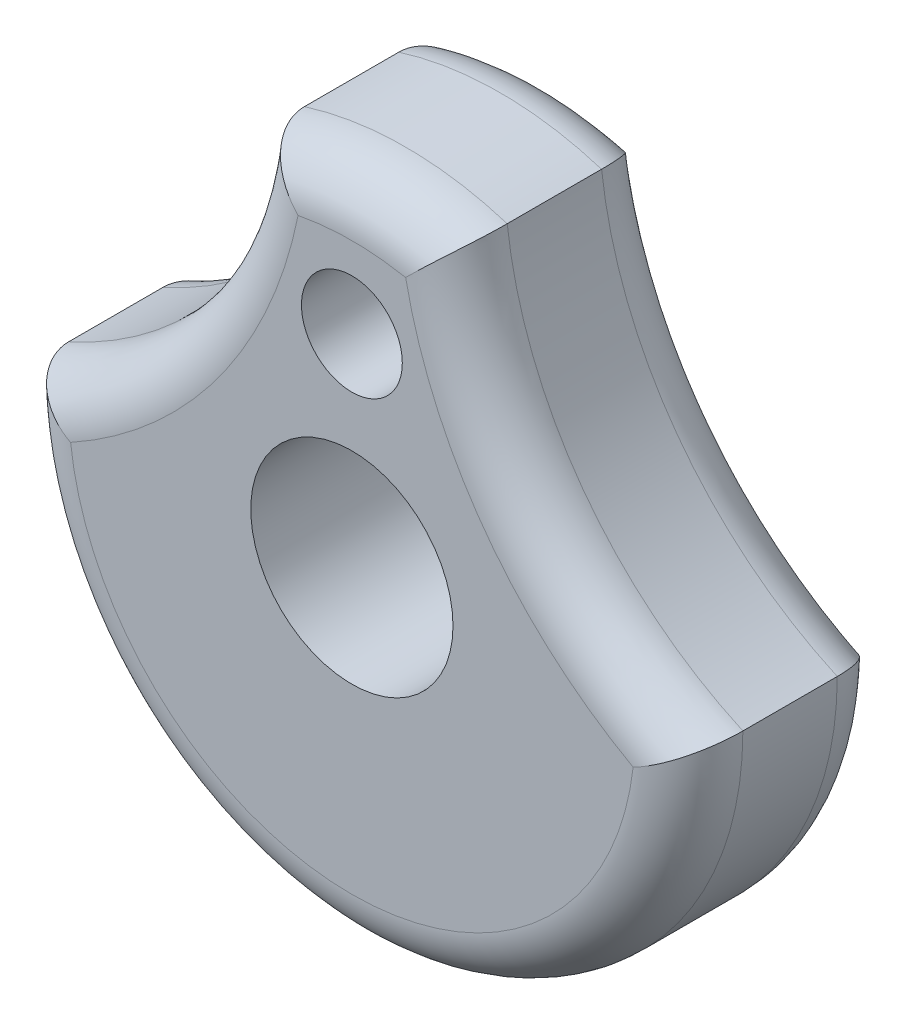
ISO-10303-21;
HEADER;
FILE_DESCRIPTION(('STEP AP214'),'2;1');
FILE_NAME('part.step','',(''),(''),'','','');
FILE_SCHEMA(('AUTOMOTIVE_DESIGN { 1 0 10303 214 1 1 1 1 }'));
ENDSEC;
DATA;
#1=APPLICATION_CONTEXT('core data for automotive mechanical design processes');
#2=APPLICATION_PROTOCOL_DEFINITION('international standard','automotive_design',2000,#1);
#3=PRODUCT_CONTEXT('',#1,'mechanical');
#4=PRODUCT('Part','Part','',(#3));
#5=PRODUCT_RELATED_PRODUCT_CATEGORY('part','',(#4));
#6=PRODUCT_DEFINITION_FORMATION('','',#4);
#7=PRODUCT_DEFINITION_CONTEXT('part definition',#1,'design');
#8=PRODUCT_DEFINITION('design','',#6,#7);
#9=PRODUCT_DEFINITION_SHAPE('','',#8);
#10=(LENGTH_UNIT() NAMED_UNIT(*) SI_UNIT(.MILLI.,.METRE.));
#11=(NAMED_UNIT(*) PLANE_ANGLE_UNIT() SI_UNIT($,.RADIAN.));
#12=(NAMED_UNIT(*) SI_UNIT($,.STERADIAN.) SOLID_ANGLE_UNIT());
#13=UNCERTAINTY_MEASURE_WITH_UNIT(LENGTH_MEASURE(1.E-05),#10,'distance_accuracy_value','');
#14=(GEOMETRIC_REPRESENTATION_CONTEXT(3) GLOBAL_UNCERTAINTY_ASSIGNED_CONTEXT((#13)) GLOBAL_UNIT_ASSIGNED_CONTEXT((#10,
#11,#12)) REPRESENTATION_CONTEXT('',''));
#15=CARTESIAN_POINT('',(0.,0.,0.));
#16=DIRECTION('',(0.,0.,1.));
#17=DIRECTION('',(1.,0.,0.));
#18=AXIS2_PLACEMENT_3D('',#15,#16,#17);
#19=CARTESIAN_POINT('',(0.,0.,9.525));
#20=DIRECTION('',(0.,0.,-1.));
#21=DIRECTION('',(-1.,0.,0.));
#22=AXIS2_PLACEMENT_3D('',#19,#20,#21);
#23=CYLINDRICAL_SURFACE('',#22,15.875);
#24=DIRECTION('',(0.,0.,1.));
#25=VECTOR('',#24,1.);
#26=CARTESIAN_POINT('',(4.7752,15.1397850037575,0.3175));
#27=LINE('',#26,#25);
#28=CARTESIAN_POINT('',(4.7752,15.1397850037575,2.54));
#29=VERTEX_POINT('',#28);
#30=CARTESIAN_POINT('',(4.7752,15.1397850037575,6.985));
#31=VERTEX_POINT('',#30);
#32=EDGE_CURVE('E147',#29,#31,#27,.T.);
#33=ORIENTED_EDGE('',*,*,#32,.F.);
#34=CARTESIAN_POINT('',(0.,0.,2.54));
#35=DIRECTION('',(0.,0.,1.));
#36=DIRECTION('',(1.,0.,0.));
#37=AXIS2_PLACEMENT_3D('',#34,#35,#36);
#38=CIRCLE('',#37,15.875);
#39=CARTESIAN_POINT('',(-4.7752,15.1397850037575,2.54));
#40=VERTEX_POINT('',#39);
#41=EDGE_CURVE('E304',#29,#40,#38,.T.);
#42=ORIENTED_EDGE('',*,*,#41,.T.);
#43=DIRECTION('',(0.,0.,1.));
#44=VECTOR('',#43,1.);
#45=CARTESIAN_POINT('',(-4.7752,15.1397850037575,0.3175));
#46=LINE('',#45,#44);
#47=CARTESIAN_POINT('',(-4.7752,15.1397850037575,6.985));
#48=VERTEX_POINT('',#47);
#49=EDGE_CURVE('E137',#40,#48,#46,.T.);
#50=ORIENTED_EDGE('',*,*,#49,.T.);
#51=CARTESIAN_POINT('',(0.,0.,6.985));
#52=DIRECTION('',(0.,0.,1.));
#53=DIRECTION('',(1.,0.,0.));
#54=AXIS2_PLACEMENT_3D('',#51,#52,#53);
#55=CIRCLE('',#54,15.875);
#56=EDGE_CURVE('E162',#48,#31,#55,.F.);
#57=ORIENTED_EDGE('',*,*,#56,.T.);
#58=EDGE_LOOP('',(#33,#42,#50,#57));
#59=FACE_BOUND('',#58,.T.);
#60=ADVANCED_FACE('F42',(#59),#23,.T.);
#61=DIRECTION('',(0.,0.,1.));
#62=VECTOR('',#61,1.);
#63=CARTESIAN_POINT('',(-15.875,0.,0.3175));
#64=LINE('',#63,#62);
#65=CARTESIAN_POINT('',(-15.875,0.,6.985));
#66=VERTEX_POINT('',#65);
#67=CARTESIAN_POINT('',(-15.875,0.,2.54));
#68=VERTEX_POINT('',#67);
#69=EDGE_CURVE('E292',#66,#68,#64,.F.);
#70=ORIENTED_EDGE('',*,*,#69,.T.);
#71=CARTESIAN_POINT('',(0.,0.,2.54));
#72=DIRECTION('',(0.,0.,1.));
#73=DIRECTION('',(1.,0.,0.));
#74=AXIS2_PLACEMENT_3D('',#71,#72,#73);
#75=CIRCLE('',#74,15.875);
#76=CARTESIAN_POINT('',(15.875,0.,2.54));
#77=VERTEX_POINT('',#76);
#78=EDGE_CURVE('E11',#68,#77,#75,.T.);
#79=ORIENTED_EDGE('',*,*,#78,.T.);
#80=DIRECTION('',(0.,0.,1.));
#81=VECTOR('',#80,1.);
#82=CARTESIAN_POINT('',(15.875,0.,0.3175));
#83=LINE('',#82,#81);
#84=CARTESIAN_POINT('',(15.875,0.,6.985));
#85=VERTEX_POINT('',#84);
#86=EDGE_CURVE('E144',#85,#77,#83,.F.);
#87=ORIENTED_EDGE('',*,*,#86,.F.);
#88=CARTESIAN_POINT('',(0.,0.,6.985));
#89=DIRECTION('',(0.,0.,1.));
#90=DIRECTION('',(1.,0.,0.));
#91=AXIS2_PLACEMENT_3D('',#88,#89,#90);
#92=CIRCLE('',#91,15.875);
#93=EDGE_CURVE('E168',#85,#66,#92,.F.);
#94=ORIENTED_EDGE('',*,*,#93,.T.);
#95=EDGE_LOOP('',(#70,#79,#87,#94));
#96=FACE_BOUND('',#95,.T.);
#97=ADVANCED_FACE('F251',(#96),#23,.T.);
#98=CARTESIAN_POINT('',(0.,0.,9.525));
#99=DIRECTION('',(0.,0.,1.));
#100=DIRECTION('',(1.,0.,0.));
#101=AXIS2_PLACEMENT_3D('',#98,#99,#100);
#102=PLANE('',#101);
#103=CARTESIAN_POINT('',(0.,0.,9.525));
#104=DIRECTION('',(0.,0.,1.));
#105=DIRECTION('',(1.,0.,0.));
#106=AXIS2_PLACEMENT_3D('',#103,#104,#105);
#107=CIRCLE('',#106,13.335);
#108=CARTESIAN_POINT('',(-13.247728473695,-1.5231268125964,9.525));
#109=VERTEX_POINT('',#108);
#110=CARTESIAN_POINT('',(13.247728473695,-1.52312681259641,9.525));
#111=VERTEX_POINT('',#110);
#112=EDGE_CURVE('E119',#109,#111,#107,.T.);
#113=ORIENTED_EDGE('',*,*,#112,.T.);
#114=CARTESIAN_POINT('',(23.6940383838059,17.3713885096318,9.525));
#115=DIRECTION('',(0.,0.,1.));
#116=DIRECTION('',(1.,0.,0.));
#117=AXIS2_PLACEMENT_3D('',#114,#115,#116);
#118=CIRCLE('',#117,21.59);
#119=CARTESIAN_POINT('',(2.53233011221546,13.0923462069549,9.525));
#120=VERTEX_POINT('',#119);
#121=EDGE_CURVE('E155',#111,#120,#118,.F.);
#122=ORIENTED_EDGE('',*,*,#121,.T.);
#123=CARTESIAN_POINT('',(0.,0.,9.525));
#124=DIRECTION('',(0.,0.,1.));
#125=DIRECTION('',(1.,0.,0.));
#126=AXIS2_PLACEMENT_3D('',#123,#124,#125);
#127=CIRCLE('',#126,13.335);
#128=CARTESIAN_POINT('',(-2.53233011221546,13.0923462069549,9.525));
#129=VERTEX_POINT('',#128);
#130=EDGE_CURVE('E122',#120,#129,#127,.T.);
#131=ORIENTED_EDGE('',*,*,#130,.T.);
#132=CARTESIAN_POINT('',(-23.6940383838059,17.3713885096318,9.525));
#133=DIRECTION('',(0.,0.,1.));
#134=DIRECTION('',(1.,0.,0.));
#135=AXIS2_PLACEMENT_3D('',#132,#133,#134);
#136=CIRCLE('',#135,21.59);
#137=EDGE_CURVE('E113',#129,#109,#136,.F.);
#138=ORIENTED_EDGE('',*,*,#137,.T.);
#139=EDGE_LOOP('',(#113,#122,#131,#138));
#140=FACE_BOUND('',#139,.T.);
#141=CARTESIAN_POINT('',(0.,0.,9.525));
#142=DIRECTION('',(0.,0.,1.));
#143=DIRECTION('',(1.,0.,0.));
#144=AXIS2_PLACEMENT_3D('',#141,#142,#143);
#145=CIRCLE('',#144,4.7625);
#146=CARTESIAN_POINT('',(4.7625,0.,9.525));
#147=VERTEX_POINT('',#146);
#148=EDGE_CURVE('E281',#147,#147,#145,.T.);
#149=ORIENTED_EDGE('',*,*,#148,.F.);
#150=EDGE_LOOP('',(#149));
#151=FACE_BOUND('',#150,.T.);
#152=CARTESIAN_POINT('',(0.,9.525,9.525));
#153=DIRECTION('',(0.,0.,1.));
#154=DIRECTION('',(1.,0.,0.));
#155=AXIS2_PLACEMENT_3D('',#152,#153,#154);
#156=CIRCLE('',#155,2.3749);
#157=CARTESIAN_POINT('',(2.3749,9.525,9.525));
#158=VERTEX_POINT('',#157);
#159=EDGE_CURVE('E150',#158,#158,#156,.T.);
#160=ORIENTED_EDGE('',*,*,#159,.F.);
#161=EDGE_LOOP('',(#160));
#162=FACE_BOUND('',#161,.T.);
#163=ADVANCED_FACE('F115',(#140,#151,#162),#102,.T.);
#164=CARTESIAN_POINT('',(0.,0.,0.));
#165=DIRECTION('',(0.,0.,1.));
#166=DIRECTION('',(1.,0.,0.));
#167=AXIS2_PLACEMENT_3D('',#164,#165,#166);
#168=PLANE('',#167);
#169=CARTESIAN_POINT('',(0.,0.,0.));
#170=DIRECTION('',(0.,0.,1.));
#171=DIRECTION('',(1.,0.,0.));
#172=AXIS2_PLACEMENT_3D('',#169,#170,#171);
#173=CIRCLE('',#172,13.335);
#174=CARTESIAN_POINT('',(13.247728473695,-1.52312681259641,0.));
#175=VERTEX_POINT('',#174);
#176=CARTESIAN_POINT('',(-13.247728473695,-1.5231268125964,0.));
#177=VERTEX_POINT('',#176);
#178=EDGE_CURVE('E171',#175,#177,#173,.F.);
#179=ORIENTED_EDGE('',*,*,#178,.T.);
#180=CARTESIAN_POINT('',(-23.6940383838059,17.3713885096318,0.));
#181=DIRECTION('',(0.,0.,1.));
#182=DIRECTION('',(1.,0.,0.));
#183=AXIS2_PLACEMENT_3D('',#180,#181,#182);
#184=CIRCLE('',#183,21.59);
#185=CARTESIAN_POINT('',(-2.53233011221546,13.0923462069549,0.));
#186=VERTEX_POINT('',#185);
#187=EDGE_CURVE('E324',#177,#186,#184,.T.);
#188=ORIENTED_EDGE('',*,*,#187,.T.);
#189=CARTESIAN_POINT('',(0.,0.,0.));
#190=DIRECTION('',(0.,0.,1.));
#191=DIRECTION('',(1.,0.,0.));
#192=AXIS2_PLACEMENT_3D('',#189,#190,#191);
#193=CIRCLE('',#192,13.335);
#194=CARTESIAN_POINT('',(2.53233011221546,13.0923462069549,0.));
#195=VERTEX_POINT('',#194);
#196=EDGE_CURVE('E330',#186,#195,#193,.F.);
#197=ORIENTED_EDGE('',*,*,#196,.T.);
#198=CARTESIAN_POINT('',(23.6940383838059,17.3713885096318,0.));
#199=DIRECTION('',(0.,0.,1.));
#200=DIRECTION('',(1.,0.,0.));
#201=AXIS2_PLACEMENT_3D('',#198,#199,#200);
#202=CIRCLE('',#201,21.59);
#203=EDGE_CURVE('E314',#195,#175,#202,.T.);
#204=ORIENTED_EDGE('',*,*,#203,.T.);
#205=EDGE_LOOP('',(#179,#188,#197,#204));
#206=FACE_BOUND('',#205,.T.);
#207=CARTESIAN_POINT('',(0.,9.525,0.));
#208=DIRECTION('',(0.,0.,1.));
#209=DIRECTION('',(1.,0.,0.));
#210=AXIS2_PLACEMENT_3D('',#207,#208,#209);
#211=CIRCLE('',#210,2.3749);
#212=CARTESIAN_POINT('',(2.3749,9.525,0.));
#213=VERTEX_POINT('',#212);
#214=EDGE_CURVE('E287',#213,#213,#211,.T.);
#215=ORIENTED_EDGE('',*,*,#214,.T.);
#216=EDGE_LOOP('',(#215));
#217=FACE_BOUND('',#216,.T.);
#218=CARTESIAN_POINT('',(0.,0.,0.));
#219=DIRECTION('',(0.,0.,1.));
#220=DIRECTION('',(1.,0.,0.));
#221=AXIS2_PLACEMENT_3D('',#218,#219,#220);
#222=CIRCLE('',#221,4.7625);
#223=CARTESIAN_POINT('',(4.7625,0.,0.));
#224=VERTEX_POINT('',#223);
#225=EDGE_CURVE('E284',#224,#224,#222,.T.);
#226=ORIENTED_EDGE('',*,*,#225,.T.);
#227=EDGE_LOOP('',(#226));
#228=FACE_BOUND('',#227,.T.);
#229=ADVANCED_FACE('F257',(#206,#217,#228),#168,.F.);
#230=CARTESIAN_POINT('',(0.,0.,-8.89));
#231=DIRECTION('',(0.,0.,1.));
#232=DIRECTION('',(1.,0.,0.));
#233=AXIS2_PLACEMENT_3D('',#230,#231,#232);
#234=CYLINDRICAL_SURFACE('',#233,4.7625);
#235=ORIENTED_EDGE('',*,*,#148,.T.);
#236=EDGE_LOOP('',(#235));
#237=FACE_BOUND('',#236,.T.);
#238=ORIENTED_EDGE('',*,*,#225,.F.);
#239=EDGE_LOOP('',(#238));
#240=FACE_BOUND('',#239,.T.);
#241=ADVANCED_FACE('F260',(#237,#240),#234,.F.);
#242=CARTESIAN_POINT('',(0.,9.525,-8.89));
#243=DIRECTION('',(0.,0.,1.));
#244=DIRECTION('',(1.,0.,0.));
#245=AXIS2_PLACEMENT_3D('',#242,#243,#244);
#246=CYLINDRICAL_SURFACE('',#245,2.3749);
#247=ORIENTED_EDGE('',*,*,#159,.T.);
#248=EDGE_LOOP('',(#247));
#249=FACE_BOUND('',#248,.T.);
#250=ORIENTED_EDGE('',*,*,#214,.F.);
#251=EDGE_LOOP('',(#250));
#252=FACE_BOUND('',#251,.T.);
#253=ADVANCED_FACE('F270',(#249,#252),#246,.F.);
#254=CARTESIAN_POINT('',(23.6940383838059,17.3713885096318,-8.89));
#255=DIRECTION('',(0.,0.,1.));
#256=DIRECTION('',(1.,0.,0.));
#257=AXIS2_PLACEMENT_3D('',#254,#255,#256);
#258=CYLINDRICAL_SURFACE('',#257,19.05);
#259=ORIENTED_EDGE('',*,*,#86,.T.);
#260=CARTESIAN_POINT('',(23.6940383838059,17.3713885096318,2.54));
#261=DIRECTION('',(0.,0.,1.));
#262=DIRECTION('',(1.,0.,0.));
#263=AXIS2_PLACEMENT_3D('',#260,#261,#262);
#264=CIRCLE('',#263,19.05);
#265=EDGE_CURVE('E57',#77,#29,#264,.F.);
#266=ORIENTED_EDGE('',*,*,#265,.T.);
#267=ORIENTED_EDGE('',*,*,#32,.T.);
#268=CARTESIAN_POINT('',(23.6940383838059,17.3713885096318,6.985));
#269=DIRECTION('',(0.,0.,1.));
#270=DIRECTION('',(1.,0.,0.));
#271=AXIS2_PLACEMENT_3D('',#268,#269,#270);
#272=CIRCLE('',#271,19.05);
#273=EDGE_CURVE('E158',#31,#85,#272,.T.);
#274=ORIENTED_EDGE('',*,*,#273,.T.);
#275=EDGE_LOOP('',(#259,#266,#267,#274));
#276=FACE_BOUND('',#275,.T.);
#277=ADVANCED_FACE('F266',(#276),#258,.F.);
#278=CARTESIAN_POINT('',(-23.6940383838059,17.3713885096318,-8.89));
#279=DIRECTION('',(0.,0.,1.));
#280=DIRECTION('',(1.,0.,0.));
#281=AXIS2_PLACEMENT_3D('',#278,#279,#280);
#282=CYLINDRICAL_SURFACE('',#281,19.05);
#283=ORIENTED_EDGE('',*,*,#49,.F.);
#284=CARTESIAN_POINT('',(-23.6940383838059,17.3713885096318,2.54));
#285=DIRECTION('',(0.,0.,1.));
#286=DIRECTION('',(1.,0.,0.));
#287=AXIS2_PLACEMENT_3D('',#284,#285,#286);
#288=CIRCLE('',#287,19.05);
#289=EDGE_CURVE('E319',#40,#68,#288,.F.);
#290=ORIENTED_EDGE('',*,*,#289,.T.);
#291=ORIENTED_EDGE('',*,*,#69,.F.);
#292=CARTESIAN_POINT('',(-23.6940383838059,17.3713885096318,6.985));
#293=DIRECTION('',(0.,0.,1.));
#294=DIRECTION('',(1.,0.,0.));
#295=AXIS2_PLACEMENT_3D('',#292,#293,#294);
#296=CIRCLE('',#295,19.05);
#297=EDGE_CURVE('E133',#66,#48,#296,.T.);
#298=ORIENTED_EDGE('',*,*,#297,.T.);
#299=EDGE_LOOP('',(#283,#290,#291,#298));
#300=FACE_BOUND('',#299,.T.);
#301=ADVANCED_FACE('F210',(#300),#282,.F.);
#302=CARTESIAN_POINT('',(-23.6940383838059,17.3713885096318,6.985));
#303=DIRECTION('',(0.,0.,1.));
#304=DIRECTION('',(1.,0.,0.));
#305=AXIS2_PLACEMENT_3D('',#302,#303,#304);
#306=TOROIDAL_SURFACE('',#305,21.59,2.54);
#307=CARTESIAN_POINT('',(-4.7752,15.1397850037575,6.985));
#308=CARTESIAN_POINT('',(-4.7752115681018,15.1397925817922,7.04826242028002));
#309=CARTESIAN_POINT('',(-4.77303212651408,15.1379908448443,7.11151793293338));
#310=CARTESIAN_POINT('',(-4.76437952419241,15.13082723461,7.23750788695464));
#311=CARTESIAN_POINT('',(-4.75790802966657,15.125466742859,7.30024252096633));
#312=CARTESIAN_POINT('',(-4.74080082310005,15.1112783097033,7.42443328076446));
#313=CARTESIAN_POINT('',(-4.73018533268593,15.1024672057349,7.48589411144455));
#314=CARTESIAN_POINT('',(-4.70496145064737,15.0814921089141,7.60739327909863));
#315=CARTESIAN_POINT('',(-4.69035284063049,15.0693279326746,7.66743153807385));
#316=CARTESIAN_POINT('',(-4.64086975762492,15.0280307568218,7.84465575111746));
#317=CARTESIAN_POINT('',(-4.60030141536724,14.9940630078747,7.95920928073866));
#318=CARTESIAN_POINT('',(-4.50606755527998,14.9146212980624,8.17850137931814));
#319=CARTESIAN_POINT('',(-4.45238879811965,14.8691357043784,8.28322987773149));
#320=CARTESIAN_POINT('',(-4.33077187826595,14.7652264100579,8.48695286129147));
#321=CARTESIAN_POINT('',(-4.26218054287924,14.7061989156945,8.58524738782864));
#322=CARTESIAN_POINT('',(-4.11560947840222,14.5787875318009,8.76765335364544));
#323=CARTESIAN_POINT('',(-4.0376279220665,14.5104018208986,8.85176202482704));
#324=CARTESIAN_POINT('',(-3.86240649099922,14.3550240109159,9.01681394355266));
#325=CARTESIAN_POINT('',(-3.76403458199722,14.2667806230615,9.09537543600797));
#326=CARTESIAN_POINT('',(-3.5611413114909,14.0822304123791,9.23280593451396));
#327=CARTESIAN_POINT('',(-3.45661184109662,13.9859128828088,9.29164825849498));
#328=CARTESIAN_POINT('',(-3.21762758553347,13.7624445383172,9.40186348651171));
#329=CARTESIAN_POINT('',(-3.0822103755667,13.6335942502475,9.44771486608128));
#330=CARTESIAN_POINT('',(-2.81058884478541,13.3701206503433,9.50897142691469));
#331=CARTESIAN_POINT('',(-2.67438675848191,13.2355099573189,9.52443999423692));
#332=CARTESIAN_POINT('',(-2.53725085829049,13.0973078667759,9.52499502843172));
#333=CARTESIAN_POINT('',(-2.53479022392689,13.0948272166037,9.52500000556001));
#334=CARTESIAN_POINT('',(-2.53233011221546,13.0923462069549,9.525));
#335=B_SPLINE_CURVE_WITH_KNOTS('',3,(#307,#308,#309,#310,#311,#312,#313,#314,#315,#316,#317,
#318,#319,#320,#321,#322,#323,#324,#325,#326,#327,#328,#329,#330,#331,#332,#333,#334),
.UNSPECIFIED.,.F.,.F.,(4,2,2,2,2,2,2,2,2,2,2,2,2,4),(0.,0.189712597385731,0.379351589950055,
0.568076533796606,0.756811801489073,1.13350507465966,1.51058032948155,1.9098423573435,
2.3091822036345,2.7686265720319,3.22869012933076,3.80347651116092,4.37706246741576,
4.38754459436644),.UNSPECIFIED.);
#336=EDGE_CURVE('E138',#48,#129,#335,.T.);
#337=ORIENTED_EDGE('',*,*,#336,.F.);
#338=ORIENTED_EDGE('',*,*,#297,.F.);
#339=CARTESIAN_POINT('',(-15.875,0.,6.985));
#340=CARTESIAN_POINT('',(-15.87501070676,8.7528782921783E-06,7.04826242028002));
#341=CARTESIAN_POINT('',(-15.8726368371856,-0.0015277902897477,7.11151793293338));
#342=CARTESIAN_POINT('',(-15.8632022907035,-0.00762485279573185,7.23750788695464));
#343=CARTESIAN_POINT('',(-15.8561434325438,-0.0121841986580691,7.30024252096633));
#344=CARTESIAN_POINT('',(-15.837466257091,-0.0242312426534886,7.42443328076446));
#345=CARTESIAN_POINT('',(-15.8258700801112,-0.0317047203800355,7.48589411144454));
#346=CARTESIAN_POINT('',(-15.7982790541074,-0.0494511058090272,7.60739327909863));
#347=CARTESIAN_POINT('',(-15.782283964497,-0.0597241666267016,7.66743153807385));
#348=CARTESIAN_POINT('',(-15.7280148632912,-0.0944933612027829,7.84465575111746));
#349=CARTESIAN_POINT('',(-15.6834172970506,-0.122965372854309,7.95920928073866));
#350=CARTESIAN_POINT('',(-15.5793092066205,-0.188938936892081,8.17850137931814));
#351=CARTESIAN_POINT('',(-15.5197836059694,-0.226449616307277,8.28322987773149));
#352=CARTESIAN_POINT('',(-15.3841042679165,-0.311178205734996,8.48695286129147));
#353=CARTESIAN_POINT('',(-15.307178225793,-0.358837417060429,8.58524738782865));
#354=CARTESIAN_POINT('',(-15.1415790379963,-0.460295027364997,8.76765335364544));
#355=CARTESIAN_POINT('',(-15.0529036056685,-0.514094621096065,8.85176202482704));
#356=CARTESIAN_POINT('',(-14.8520151637709,-0.6344634195956,9.01681394355265));
#357=CARTESIAN_POINT('',(-14.7382683001498,-0.701735843344687,9.09537543600797));
#358=CARTESIAN_POINT('',(-14.5012348225151,-0.839719864013962,9.23280593451395));
#359=CARTESIAN_POINT('',(-14.3779355584637,-0.910435973690942,9.29164825849498));
#360=CARTESIAN_POINT('',(-14.0929301847368,-1.07113293179435,9.40186348651171));
#361=CARTESIAN_POINT('',(-13.9293138118184,-1.16152043095111,9.44771486608128));
#362=CARTESIAN_POINT('',(-13.5963386439128,-1.34130956129209,9.50897142691469));
#363=CARTESIAN_POINT('',(-13.426992555465,-1.43071285718977,9.52443999423692));
#364=CARTESIAN_POINT('',(-13.2539405057964,-1.51992642710625,9.52499502843172));
#365=CARTESIAN_POINT('',(-13.2508345825529,-1.52152692313995,9.52500000556001));
#366=CARTESIAN_POINT('',(-13.247728473695,-1.5231268125964,9.525));
#367=B_SPLINE_CURVE_WITH_KNOTS('',3,(#339,#340,#341,#342,#343,#344,#345,#346,#347,#348,#349,
#350,#351,#352,#353,#354,#355,#356,#357,#358,#359,#360,#361,#362,#363,#364,#365,#366),
.UNSPECIFIED.,.F.,.F.,(4,2,2,2,2,2,2,2,2,2,2,2,2,4),(0.,0.189712597385731,0.379351589950055,
0.568076533796605,0.756811801489073,1.13350507465966,1.51058032948155,1.9098423573435,
2.3091822036345,2.76862657203189,3.22869012933075,3.80347651116093,4.37706246741576,
4.38754459436645),.UNSPECIFIED.);
#368=EDGE_CURVE('E130',#109,#66,#367,.F.);
#369=ORIENTED_EDGE('',*,*,#368,.F.);
#370=ORIENTED_EDGE('',*,*,#137,.F.);
#371=EDGE_LOOP('',(#337,#338,#369,#370));
#372=FACE_BOUND('',#371,.T.);
#373=ADVANCED_FACE('F131',(#372),#306,.T.);
#374=CARTESIAN_POINT('',(0.,0.,6.985));
#375=DIRECTION('',(0.,0.,1.));
#376=DIRECTION('',(1.,0.,0.));
#377=AXIS2_PLACEMENT_3D('',#374,#375,#376);
#378=TOROIDAL_SURFACE('',#377,13.335,2.54);
#379=ORIENTED_EDGE('',*,*,#368,.T.);
#380=ORIENTED_EDGE('',*,*,#93,.F.);
#381=CARTESIAN_POINT('',(15.875,0.,6.985));
#382=CARTESIAN_POINT('',(15.87501070676,8.75287828754924E-06,7.04826242028002));
#383=CARTESIAN_POINT('',(15.8726368371856,-0.00152779028975302,7.11151793293338));
#384=CARTESIAN_POINT('',(15.8632022907035,-0.00762485279573911,7.23750788695464));
#385=CARTESIAN_POINT('',(15.8561434325438,-0.0121841986580777,7.30024252096633));
#386=CARTESIAN_POINT('',(15.837466257091,-0.0242312426534947,7.42443328076446));
#387=CARTESIAN_POINT('',(15.8258700801112,-0.0317047203800381,7.48589411144455));
#388=CARTESIAN_POINT('',(15.7982790541074,-0.0494511058090303,7.60739327909863));
#389=CARTESIAN_POINT('',(15.782283964497,-0.0597241666267086,7.66743153807385));
#390=CARTESIAN_POINT('',(15.7280148632912,-0.0944933612027952,7.84465575111746));
#391=CARTESIAN_POINT('',(15.6834172970506,-0.122965372854316,7.95920928073866));
#392=CARTESIAN_POINT('',(15.5793092066205,-0.188938936892086,8.17850137931814));
#393=CARTESIAN_POINT('',(15.5197836059694,-0.226449616307285,8.28322987773149));
#394=CARTESIAN_POINT('',(15.3841042679165,-0.311178205735006,8.48695286129147));
#395=CARTESIAN_POINT('',(15.307178225793,-0.358837417060437,8.58524738782864));
#396=CARTESIAN_POINT('',(15.1415790379963,-0.460295027365003,8.76765335364544));
#397=CARTESIAN_POINT('',(15.0529036056685,-0.514094621096071,8.85176202482704));
#398=CARTESIAN_POINT('',(14.8520151637709,-0.634463419595613,9.01681394355265));
#399=CARTESIAN_POINT('',(14.7382683001498,-0.701735843344707,9.09537543600797));
#400=CARTESIAN_POINT('',(14.5012348225151,-0.839719864013965,9.23280593451396));
#401=CARTESIAN_POINT('',(14.3779355584637,-0.91043597369092,9.29164825849498));
#402=CARTESIAN_POINT('',(14.0929301847369,-1.0711329317944,9.40186348651171));
#403=CARTESIAN_POINT('',(13.9293138118185,-1.16152043095128,9.44771486608128));
#404=CARTESIAN_POINT('',(13.5963386439128,-1.34130956129191,9.50897142691469));
#405=CARTESIAN_POINT('',(13.4269925554647,-1.43071285718911,9.52443999423692));
#406=CARTESIAN_POINT('',(13.2539405057964,-1.51992642710623,9.52499502843172));
#407=CARTESIAN_POINT('',(13.2508345825529,-1.52152692313994,9.52500000556001));
#408=CARTESIAN_POINT('',(13.247728473695,-1.52312681259641,9.525));
#409=B_SPLINE_CURVE_WITH_KNOTS('',3,(#381,#382,#383,#384,#385,#386,#387,#388,#389,#390,#391,
#392,#393,#394,#395,#396,#397,#398,#399,#400,#401,#402,#403,#404,#405,#406,#407,#408),
.UNSPECIFIED.,.F.,.F.,(4,2,2,2,2,2,2,2,2,2,2,2,2,4),(0.,0.189712597385731,0.379351589950056,
0.568076533796608,0.756811801489074,1.13350507465966,1.51058032948155,1.9098423573435,
2.3091822036345,2.7686265720319,3.22869012933076,3.80347651116091,4.37706246741575,
4.38754459436644),.UNSPECIFIED.);
#410=EDGE_CURVE('E141',#111,#85,#409,.F.);
#411=ORIENTED_EDGE('',*,*,#410,.F.);
#412=ORIENTED_EDGE('',*,*,#112,.F.);
#413=EDGE_LOOP('',(#379,#380,#411,#412));
#414=FACE_BOUND('',#413,.T.);
#415=ADVANCED_FACE('F140',(#414),#378,.T.);
#416=CARTESIAN_POINT('',(0.,0.,6.985));
#417=DIRECTION('',(0.,0.,1.));
#418=DIRECTION('',(1.,0.,0.));
#419=AXIS2_PLACEMENT_3D('',#416,#417,#418);
#420=TOROIDAL_SURFACE('',#419,13.335,2.54);
#421=ORIENTED_EDGE('',*,*,#336,.T.);
#422=ORIENTED_EDGE('',*,*,#130,.F.);
#423=CARTESIAN_POINT('',(4.7752,15.1397850037575,6.985));
#424=CARTESIAN_POINT('',(4.77521156810179,15.1397925817922,7.04826242028002));
#425=CARTESIAN_POINT('',(4.77303212651408,15.1379908448443,7.11151793293338));
#426=CARTESIAN_POINT('',(4.76437952419241,15.13082723461,7.23750788695464));
#427=CARTESIAN_POINT('',(4.75790802966656,15.125466742859,7.30024252096633));
#428=CARTESIAN_POINT('',(4.74080082310004,15.1112783097033,7.42443328076446));
#429=CARTESIAN_POINT('',(4.73018533268592,15.1024672057349,7.48589411144455));
#430=CARTESIAN_POINT('',(4.70496145064736,15.0814921089141,7.60739327909863));
#431=CARTESIAN_POINT('',(4.69035284063048,15.0693279326746,7.66743153807385));
#432=CARTESIAN_POINT('',(4.64086975762492,15.0280307568219,7.84465575111746));
#433=CARTESIAN_POINT('',(4.60030141536723,14.9940630078747,7.95920928073866));
#434=CARTESIAN_POINT('',(4.50606755527997,14.9146212980625,8.17850137931814));
#435=CARTESIAN_POINT('',(4.45238879811964,14.8691357043784,8.28322987773149));
#436=CARTESIAN_POINT('',(4.33077187826594,14.7652264100579,8.48695286129147));
#437=CARTESIAN_POINT('',(4.26218054287924,14.7061989156945,8.58524738782865));
#438=CARTESIAN_POINT('',(4.11560947840222,14.5787875318009,8.76765335364544));
#439=CARTESIAN_POINT('',(4.03762792206649,14.5104018208986,8.85176202482704));
#440=CARTESIAN_POINT('',(3.86240649099921,14.3550240109159,9.01681394355265));
#441=CARTESIAN_POINT('',(3.76403458199721,14.2667806230615,9.09537543600797));
#442=CARTESIAN_POINT('',(3.5611413114909,14.0822304123791,9.23280593451395));
#443=CARTESIAN_POINT('',(3.45661184109663,13.9859128828088,9.29164825849498));
#444=CARTESIAN_POINT('',(3.21762758553346,13.7624445383172,9.40186348651171));
#445=CARTESIAN_POINT('',(3.08221037556665,13.6335942502476,9.44771486608128));
#446=CARTESIAN_POINT('',(2.81058884478546,13.3701206503433,9.50897142691469));
#447=CARTESIAN_POINT('',(2.67438675848208,13.2355099573187,9.52443999423692));
#448=CARTESIAN_POINT('',(2.53725085829049,13.0973078667759,9.52499502843172));
#449=CARTESIAN_POINT('',(2.53479022392689,13.0948272166037,9.52500000556001));
#450=CARTESIAN_POINT('',(2.53233011221546,13.0923462069549,9.525));
#451=B_SPLINE_CURVE_WITH_KNOTS('',3,(#423,#424,#425,#426,#427,#428,#429,#430,#431,#432,#433,
#434,#435,#436,#437,#438,#439,#440,#441,#442,#443,#444,#445,#446,#447,#448,#449,#450),
.UNSPECIFIED.,.F.,.F.,(4,2,2,2,2,2,2,2,2,2,2,2,2,4),(0.,0.189712597385731,0.379351589950055,
0.568076533796606,0.756811801489073,1.13350507465966,1.51058032948155,1.9098423573435,
2.3091822036345,2.76862657203189,3.22869012933075,3.80347651116091,4.37706246741576,
4.38754459436644),.UNSPECIFIED.);
#452=EDGE_CURVE('E172',#31,#120,#451,.T.);
#453=ORIENTED_EDGE('',*,*,#452,.F.);
#454=ORIENTED_EDGE('',*,*,#56,.F.);
#455=EDGE_LOOP('',(#421,#422,#453,#454));
#456=FACE_BOUND('',#455,.T.);
#457=ADVANCED_FACE('F190',(#456),#420,.T.);
#458=CARTESIAN_POINT('',(23.6940383838059,17.3713885096318,6.985));
#459=DIRECTION('',(0.,0.,1.));
#460=DIRECTION('',(1.,0.,0.));
#461=AXIS2_PLACEMENT_3D('',#458,#459,#460);
#462=TOROIDAL_SURFACE('',#461,21.59,2.54);
#463=ORIENTED_EDGE('',*,*,#410,.T.);
#464=ORIENTED_EDGE('',*,*,#273,.F.);
#465=ORIENTED_EDGE('',*,*,#452,.T.);
#466=ORIENTED_EDGE('',*,*,#121,.F.);
#467=EDGE_LOOP('',(#463,#464,#465,#466));
#468=FACE_BOUND('',#467,.T.);
#469=ADVANCED_FACE('F187',(#468),#462,.T.);
#470=CARTESIAN_POINT('',(23.6940383838059,17.3713885096318,2.54));
#471=DIRECTION('',(0.,0.,1.));
#472=DIRECTION('',(1.,0.,0.));
#473=AXIS2_PLACEMENT_3D('',#470,#471,#472);
#474=TOROIDAL_SURFACE('',#473,21.59,2.54);
#475=CARTESIAN_POINT('',(4.7752,15.1397850037575,2.54));
#476=CARTESIAN_POINT('',(4.77521156810179,15.1397925817922,2.47673757971998));
#477=CARTESIAN_POINT('',(4.77303212651408,15.1379908448443,2.41348206706662));
#478=CARTESIAN_POINT('',(4.76437952419241,15.13082723461,2.28749211304536));
#479=CARTESIAN_POINT('',(4.75790802966656,15.125466742859,2.22475747903367));
#480=CARTESIAN_POINT('',(4.74080082310004,15.1112783097034,2.10056671923554));
#481=CARTESIAN_POINT('',(4.73018533268592,15.1024672057349,2.03910588855546));
#482=CARTESIAN_POINT('',(4.70496145064736,15.0814921089141,1.91760672090137));
#483=CARTESIAN_POINT('',(4.69035284063048,15.0693279326746,1.85756846192615));
#484=CARTESIAN_POINT('',(4.64086975762492,15.0280307568219,1.68034424888254));
#485=CARTESIAN_POINT('',(4.60030141536723,14.9940630078747,1.56579071926134));
#486=CARTESIAN_POINT('',(4.50606755527997,14.9146212980625,1.34649862068186));
#487=CARTESIAN_POINT('',(4.45238879811964,14.8691357043784,1.24177012226851));
#488=CARTESIAN_POINT('',(4.33077187826594,14.7652264100579,1.03804713870853));
#489=CARTESIAN_POINT('',(4.26218054287924,14.7061989156945,0.939752612171354));
#490=CARTESIAN_POINT('',(4.11560947840222,14.5787875318009,0.757346646354559));
#491=CARTESIAN_POINT('',(4.03762792206649,14.5104018208986,0.67323797517296));
#492=CARTESIAN_POINT('',(3.86240649099921,14.3550240109159,0.508186056447349));
#493=CARTESIAN_POINT('',(3.76403458199722,14.2667806230615,0.429624563992032));
#494=CARTESIAN_POINT('',(3.5611413114909,14.0822304123792,0.292194065486048));
#495=CARTESIAN_POINT('',(3.4566118410966,13.9859128828088,0.233351741505024));
#496=CARTESIAN_POINT('',(3.21762758553348,13.7624445383171,0.123136513488288));
#497=CARTESIAN_POINT('',(3.08221037556678,13.6335942502474,0.077285133918722));
#498=CARTESIAN_POINT('',(2.81058884478531,13.3701206503434,0.0160285730853057));
#499=CARTESIAN_POINT('',(2.67438675848155,13.2355099573192,0.000560005763085934));
#500=CARTESIAN_POINT('',(2.53725085829047,13.097307866776,4.97156828150253E-06));
#501=CARTESIAN_POINT('',(2.53479022392688,13.0948272166037,-5.56000804582501E-09));
#502=CARTESIAN_POINT('',(2.53233011221546,13.0923462069549,0.));
#503=B_SPLINE_CURVE_WITH_KNOTS('',3,(#475,#476,#477,#478,#479,#480,#481,#482,#483,#484,#485,
#486,#487,#488,#489,#490,#491,#492,#493,#494,#495,#496,#497,#498,#499,#500,#501,#502),
.UNSPECIFIED.,.F.,.F.,(4,2,2,2,2,2,2,2,2,2,2,2,2,4),(0.,0.189712597385731,0.379351589950055,
0.568076533796606,0.756811801489074,1.13350507465966,1.51058032948155,1.9098423573435,
2.3091822036345,2.76862657203189,3.22869012933075,3.80347651116092,4.37706246741576,
4.38754459436644),.UNSPECIFIED.);
#504=EDGE_CURVE('E233',#29,#195,#503,.T.);
#505=ORIENTED_EDGE('',*,*,#504,.F.);
#506=ORIENTED_EDGE('',*,*,#265,.F.);
#507=CARTESIAN_POINT('',(15.875,0.,2.54));
#508=CARTESIAN_POINT('',(15.87501070676,8.7528782874624E-06,2.47673757971998));
#509=CARTESIAN_POINT('',(15.8726368371856,-0.00152779028975255,2.41348206706662));
#510=CARTESIAN_POINT('',(15.8632022907035,-0.00762485279573779,2.28749211304536));
#511=CARTESIAN_POINT('',(15.8561434325438,-0.012184198658076,2.22475747903367));
#512=CARTESIAN_POINT('',(15.837466257091,-0.0242312426534943,2.10056671923554));
#513=CARTESIAN_POINT('',(15.8258700801112,-0.0317047203800392,2.03910588855545));
#514=CARTESIAN_POINT('',(15.7982790541074,-0.0494511058090317,1.91760672090137));
#515=CARTESIAN_POINT('',(15.782283964497,-0.0597241666267089,1.85756846192615));
#516=CARTESIAN_POINT('',(15.7280148632912,-0.094493361202794,1.68034424888254));
#517=CARTESIAN_POINT('',(15.6834172970506,-0.122965372854317,1.56579071926134));
#518=CARTESIAN_POINT('',(15.5793092066205,-0.188938936892086,1.34649862068186));
#519=CARTESIAN_POINT('',(15.5197836059694,-0.226449616307284,1.24177012226851));
#520=CARTESIAN_POINT('',(15.3841042679165,-0.311178205735005,1.03804713870853));
#521=CARTESIAN_POINT('',(15.307178225793,-0.358837417060438,0.939752612171355));
#522=CARTESIAN_POINT('',(15.1415790379963,-0.460295027365002,0.75734664635456));
#523=CARTESIAN_POINT('',(15.0529036056685,-0.514094621096066,0.673237975172959));
#524=CARTESIAN_POINT('',(14.8520151637709,-0.634463419595617,0.508186056447344));
#525=CARTESIAN_POINT('',(14.7382683001498,-0.701735843344727,0.429624563992026));
#526=CARTESIAN_POINT('',(14.5012348225151,-0.839719864013951,0.292194065486043));
#527=CARTESIAN_POINT('',(14.3779355584637,-0.910435973690856,0.233351741505021));
#528=CARTESIAN_POINT('',(14.0929301847369,-1.07113293179448,0.12313651348829));
#529=CARTESIAN_POINT('',(13.9293138118186,-1.16152043095162,0.0772851339187272));
#530=CARTESIAN_POINT('',(13.5963386439126,-1.34130956129158,0.0160285730853065));
#531=CARTESIAN_POINT('',(13.426992555464,-1.43071285718785,0.00056000576308275));
#532=CARTESIAN_POINT('',(13.2539405057964,-1.51992642710619,4.97156828138688E-06));
#533=CARTESIAN_POINT('',(13.2508345825529,-1.52152692313992,-5.56000810410657E-09));
#534=CARTESIAN_POINT('',(13.247728473695,-1.52312681259641,0.));
#535=B_SPLINE_CURVE_WITH_KNOTS('',3,(#507,#508,#509,#510,#511,#512,#513,#514,#515,#516,#517,
#518,#519,#520,#521,#522,#523,#524,#525,#526,#527,#528,#529,#530,#531,#532,#533,#534),
.UNSPECIFIED.,.F.,.F.,(4,2,2,2,2,2,2,2,2,2,2,2,2,4),(0.,0.189712597385732,0.379351589950056,
0.568076533796606,0.756811801489074,1.13350507465966,1.51058032948155,1.9098423573435,
2.3091822036345,2.76862657203191,3.22869012933076,3.80347651116089,4.37706246741576,
4.38754459436645),.UNSPECIFIED.);
#536=EDGE_CURVE('E47',#175,#77,#535,.F.);
#537=ORIENTED_EDGE('',*,*,#536,.F.);
#538=ORIENTED_EDGE('',*,*,#203,.F.);
#539=EDGE_LOOP('',(#505,#506,#537,#538));
#540=FACE_BOUND('',#539,.T.);
#541=ADVANCED_FACE('F44',(#540),#474,.T.);
#542=CARTESIAN_POINT('',(0.,0.,2.54));
#543=DIRECTION('',(0.,0.,1.));
#544=DIRECTION('',(1.,0.,0.));
#545=AXIS2_PLACEMENT_3D('',#542,#543,#544);
#546=TOROIDAL_SURFACE('',#545,13.335,2.54);
#547=ORIENTED_EDGE('',*,*,#536,.T.);
#548=ORIENTED_EDGE('',*,*,#78,.F.);
#549=CARTESIAN_POINT('',(-15.875,0.,2.54));
#550=CARTESIAN_POINT('',(-15.87501070676,8.75287829339028E-06,2.47673757971998));
#551=CARTESIAN_POINT('',(-15.8726368371856,-0.00152779028974652,2.41348206706662));
#552=CARTESIAN_POINT('',(-15.8632022907035,-0.00762485279573106,2.28749211304536));
#553=CARTESIAN_POINT('',(-15.8561434325438,-0.0121841986580687,2.22475747903367));
#554=CARTESIAN_POINT('',(-15.837466257091,-0.0242312426534871,2.10056671923554));
#555=CARTESIAN_POINT('',(-15.8258700801112,-0.0317047203800327,2.03910588855545));
#556=CARTESIAN_POINT('',(-15.7982790541074,-0.0494511058090247,1.91760672090137));
#557=CARTESIAN_POINT('',(-15.782283964497,-0.0597241666267007,1.85756846192615));
#558=CARTESIAN_POINT('',(-15.7280148632912,-0.0944933612027848,1.68034424888254));
#559=CARTESIAN_POINT('',(-15.6834172970506,-0.12296537285431,1.56579071926135));
#560=CARTESIAN_POINT('',(-15.5793092066205,-0.188938936892082,1.34649862068186));
#561=CARTESIAN_POINT('',(-15.5197836059694,-0.22644961630728,1.24177012226851));
#562=CARTESIAN_POINT('',(-15.3841042679165,-0.311178205734999,1.03804713870853));
#563=CARTESIAN_POINT('',(-15.307178225793,-0.35883741706043,0.939752612171355));
#564=CARTESIAN_POINT('',(-15.1415790379963,-0.460295027364994,0.757346646354559));
#565=CARTESIAN_POINT('',(-15.0529036056685,-0.514094621096061,0.67323797517296));
#566=CARTESIAN_POINT('',(-14.8520151637709,-0.634463419595601,0.508186056447349));
#567=CARTESIAN_POINT('',(-14.7382683001498,-0.701735843344697,0.429624563992033));
#568=CARTESIAN_POINT('',(-14.5012348225151,-0.839719864013958,0.292194065486048));
#569=CARTESIAN_POINT('',(-14.3779355584637,-0.910435973690915,0.233351741505024));
#570=CARTESIAN_POINT('',(-14.0929301847368,-1.07113293179438,0.123136513488287));
#571=CARTESIAN_POINT('',(-13.9293138118184,-1.16152043095125,0.0772851339187236));
#572=CARTESIAN_POINT('',(-13.5963386439128,-1.34130956129194,0.0160285730853054));
#573=CARTESIAN_POINT('',(-13.4269925554647,-1.43071285718922,0.00056000576308236));
#574=CARTESIAN_POINT('',(-13.2539405057964,-1.51992642710623,4.97156828137299E-06));
#575=CARTESIAN_POINT('',(-13.2508345825529,-1.52152692313994,-5.56000811135314E-09));
#576=CARTESIAN_POINT('',(-13.247728473695,-1.5231268125964,0.));
#577=B_SPLINE_CURVE_WITH_KNOTS('',3,(#549,#550,#551,#552,#553,#554,#555,#556,#557,#558,#559,
#560,#561,#562,#563,#564,#565,#566,#567,#568,#569,#570,#571,#572,#573,#574,#575,#576),
.UNSPECIFIED.,.F.,.F.,(4,2,2,2,2,2,2,2,2,2,2,2,2,4),(0.,0.189712597385731,0.379351589950055,
0.568076533796606,0.756811801489073,1.13350507465966,1.51058032948155,1.9098423573435,
2.3091822036345,2.76862657203189,3.22869012933075,3.80347651116092,4.37706246741576,
4.38754459436644),.UNSPECIFIED.);
#578=EDGE_CURVE('E227',#177,#68,#577,.F.);
#579=ORIENTED_EDGE('',*,*,#578,.F.);
#580=ORIENTED_EDGE('',*,*,#178,.F.);
#581=EDGE_LOOP('',(#547,#548,#579,#580));
#582=FACE_BOUND('',#581,.T.);
#583=ADVANCED_FACE('F238',(#582),#546,.T.);
#584=CARTESIAN_POINT('',(0.,0.,2.54));
#585=DIRECTION('',(0.,0.,1.));
#586=DIRECTION('',(1.,0.,0.));
#587=AXIS2_PLACEMENT_3D('',#584,#585,#586);
#588=TOROIDAL_SURFACE('',#587,13.335,2.54);
#589=ORIENTED_EDGE('',*,*,#504,.T.);
#590=ORIENTED_EDGE('',*,*,#196,.F.);
#591=CARTESIAN_POINT('',(-4.7752,15.1397850037575,2.54));
#592=CARTESIAN_POINT('',(-4.7752115681018,15.1397925817922,2.47673757971998));
#593=CARTESIAN_POINT('',(-4.77303212651408,15.1379908448443,2.41348206706662));
#594=CARTESIAN_POINT('',(-4.76437952419241,15.13082723461,2.28749211304536));
#595=CARTESIAN_POINT('',(-4.75790802966657,15.125466742859,2.22475747903367));
#596=CARTESIAN_POINT('',(-4.74080082310005,15.1112783097033,2.10056671923554));
#597=CARTESIAN_POINT('',(-4.73018533268593,15.1024672057349,2.03910588855545));
#598=CARTESIAN_POINT('',(-4.70496145064737,15.0814921089141,1.91760672090137));
#599=CARTESIAN_POINT('',(-4.69035284063049,15.0693279326746,1.85756846192615));
#600=CARTESIAN_POINT('',(-4.64086975762492,15.0280307568218,1.68034424888254));
#601=CARTESIAN_POINT('',(-4.60030141536724,14.9940630078747,1.56579071926134));
#602=CARTESIAN_POINT('',(-4.50606755527998,14.9146212980624,1.34649862068186));
#603=CARTESIAN_POINT('',(-4.45238879811965,14.8691357043784,1.24177012226851));
#604=CARTESIAN_POINT('',(-4.33077187826595,14.7652264100579,1.03804713870853));
#605=CARTESIAN_POINT('',(-4.26218054287924,14.7061989156945,0.939752612171355));
#606=CARTESIAN_POINT('',(-4.11560947840222,14.5787875318009,0.75734664635456));
#607=CARTESIAN_POINT('',(-4.0376279220665,14.5104018208986,0.673237975172959));
#608=CARTESIAN_POINT('',(-3.86240649099922,14.3550240109159,0.508186056447347));
#609=CARTESIAN_POINT('',(-3.76403458199723,14.2667806230615,0.429624563992032));
#610=CARTESIAN_POINT('',(-3.5611413114909,14.0822304123792,0.292194065486048));
#611=CARTESIAN_POINT('',(-3.4566118410966,13.9859128828088,0.233351741505024));
#612=CARTESIAN_POINT('',(-3.21762758553349,13.7624445383171,0.123136513488287));
#613=CARTESIAN_POINT('',(-3.08221037556679,13.6335942502474,0.0772851339187214));
#614=CARTESIAN_POINT('',(-2.81058884478531,13.3701206503434,0.0160285730853047));
#615=CARTESIAN_POINT('',(-2.67438675848154,13.2355099573192,0.000560005763084238));
#616=CARTESIAN_POINT('',(-2.53725085829047,13.097307866776,4.97156828144247E-06));
#617=CARTESIAN_POINT('',(-2.53479022392688,13.0948272166037,-5.56000807579971E-09));
#618=CARTESIAN_POINT('',(-2.53233011221546,13.0923462069549,0.));
#619=B_SPLINE_CURVE_WITH_KNOTS('',3,(#591,#592,#593,#594,#595,#596,#597,#598,#599,#600,#601,
#602,#603,#604,#605,#606,#607,#608,#609,#610,#611,#612,#613,#614,#615,#616,#617,#618),
.UNSPECIFIED.,.F.,.F.,(4,2,2,2,2,2,2,2,2,2,2,2,2,4),(0.,0.189712597385731,0.379351589950055,
0.568076533796607,0.756811801489073,1.13350507465966,1.51058032948155,1.9098423573435,
2.3091822036345,2.76862657203189,3.22869012933076,3.80347651116093,4.37706246741576,
4.38754459436645),.UNSPECIFIED.);
#620=EDGE_CURVE('E221',#40,#186,#619,.T.);
#621=ORIENTED_EDGE('',*,*,#620,.F.);
#622=ORIENTED_EDGE('',*,*,#41,.F.);
#623=EDGE_LOOP('',(#589,#590,#621,#622));
#624=FACE_BOUND('',#623,.T.);
#625=ADVANCED_FACE('F216',(#624),#588,.T.);
#626=CARTESIAN_POINT('',(-23.6940383838059,17.3713885096318,2.54));
#627=DIRECTION('',(0.,0.,1.));
#628=DIRECTION('',(1.,0.,0.));
#629=AXIS2_PLACEMENT_3D('',#626,#627,#628);
#630=TOROIDAL_SURFACE('',#629,21.59,2.54);
#631=ORIENTED_EDGE('',*,*,#578,.T.);
#632=ORIENTED_EDGE('',*,*,#289,.F.);
#633=ORIENTED_EDGE('',*,*,#620,.T.);
#634=ORIENTED_EDGE('',*,*,#187,.F.);
#635=EDGE_LOOP('',(#631,#632,#633,#634));
#636=FACE_BOUND('',#635,.T.);
#637=ADVANCED_FACE('F211',(#636),#630,.T.);
#638=CLOSED_SHELL('',(#60,#97,#163,#229,#241,#253,#277,#301,#373,#415,#457,#469,#541,#583,#625,#637));
#639=MANIFOLD_SOLID_BREP('B2',#638);
#640=ADVANCED_BREP_SHAPE_REPRESENTATION('',(#18,#639),#14);
#641=SHAPE_DEFINITION_REPRESENTATION(#9,#640);
ENDSEC;
END-ISO-10303-21;
